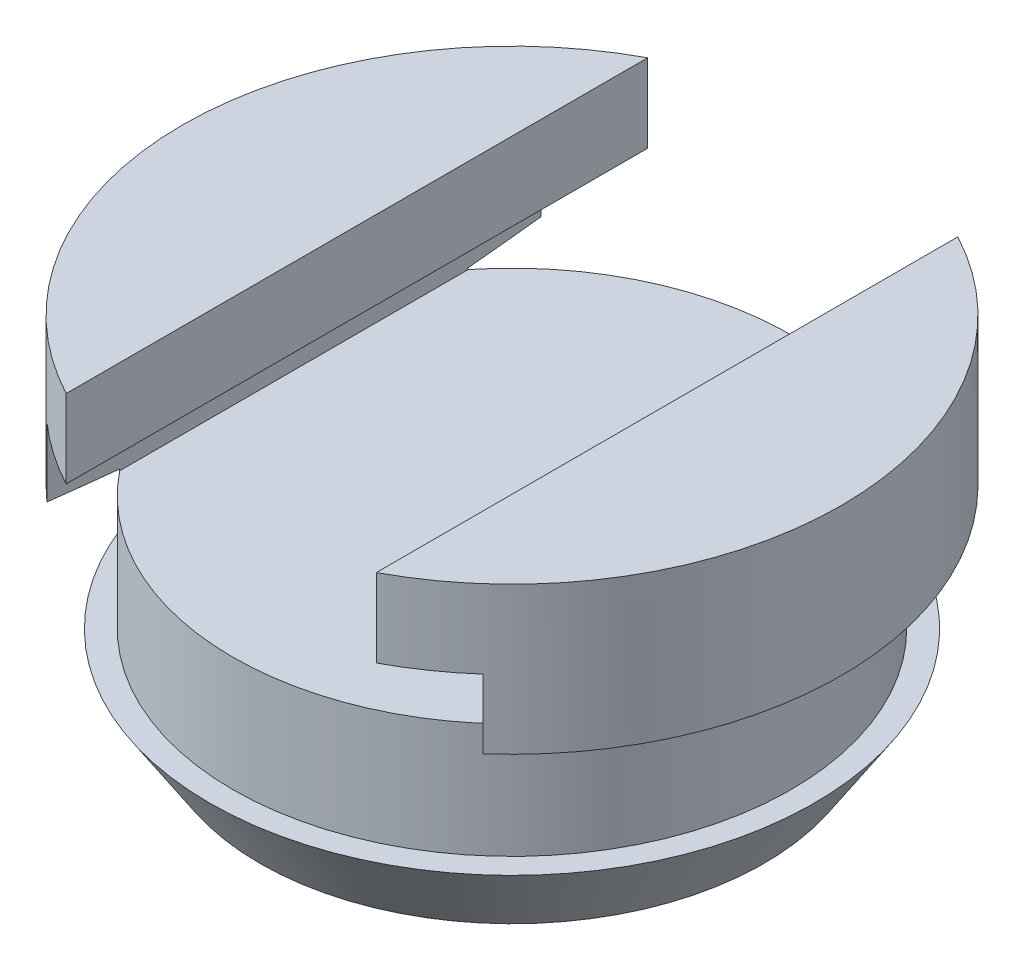
ISO-10303-21;
HEADER;
FILE_DESCRIPTION(('STEP AP214'),'2;1');
FILE_NAME('part.step','',(''),(''),'','','');
FILE_SCHEMA(('AUTOMOTIVE_DESIGN { 1 0 10303 214 1 1 1 1 }'));
ENDSEC;
DATA;
#1=APPLICATION_CONTEXT('core data for automotive mechanical design processes');
#2=APPLICATION_PROTOCOL_DEFINITION('international standard','automotive_design',2000,#1);
#3=PRODUCT_CONTEXT('',#1,'mechanical');
#4=PRODUCT('Part','Part','',(#3));
#5=PRODUCT_RELATED_PRODUCT_CATEGORY('part','',(#4));
#6=PRODUCT_DEFINITION_FORMATION('','',#4);
#7=PRODUCT_DEFINITION_CONTEXT('part definition',#1,'design');
#8=PRODUCT_DEFINITION('design','',#6,#7);
#9=PRODUCT_DEFINITION_SHAPE('','',#8);
#10=(LENGTH_UNIT() NAMED_UNIT(*) SI_UNIT(.MILLI.,.METRE.));
#11=(NAMED_UNIT(*) PLANE_ANGLE_UNIT() SI_UNIT($,.RADIAN.));
#12=(NAMED_UNIT(*) SI_UNIT($,.STERADIAN.) SOLID_ANGLE_UNIT());
#13=UNCERTAINTY_MEASURE_WITH_UNIT(LENGTH_MEASURE(1.E-05),#10,'distance_accuracy_value','');
#14=(GEOMETRIC_REPRESENTATION_CONTEXT(3) GLOBAL_UNCERTAINTY_ASSIGNED_CONTEXT((#13)) GLOBAL_UNIT_ASSIGNED_CONTEXT((#10,
#11,#12)) REPRESENTATION_CONTEXT('',''));
#15=CARTESIAN_POINT('',(0.,0.,0.));
#16=DIRECTION('',(0.,0.,1.));
#17=DIRECTION('',(1.,0.,0.));
#18=AXIS2_PLACEMENT_3D('',#15,#16,#17);
#19=CARTESIAN_POINT('',(0.,6.604,0.));
#20=DIRECTION('',(0.,1.,0.));
#21=DIRECTION('',(0.,0.,1.));
#22=AXIS2_PLACEMENT_3D('',#19,#20,#21);
#23=CONICAL_SURFACE('',#22,10.795,1.41814699839963);
#24=CARTESIAN_POINT('',(-7.14375,8.75880224403283,23.7500964395706));
#25=CARTESIAN_POINT('',(-7.14375,8.68545830838872,23.2522454636843));
#26=CARTESIAN_POINT('',(-7.14375,8.6122966619837,22.7543675871435));
#27=CARTESIAN_POINT('',(-7.14375,8.46642256016569,21.7585457203129));
#28=CARTESIAN_POINT('',(-7.14375,8.39371010504107,21.2606017299808));
#29=CARTESIAN_POINT('',(-7.14375,8.17636203087784,19.7665736462849));
#30=CARTESIAN_POINT('',(-7.14375,8.03252742900043,18.7703728475509));
#31=CARTESIAN_POINT('',(-7.14375,7.74699954261901,16.7702331852527));
#32=CARTESIAN_POINT('',(-7.14375,7.60532958718924,15.7662909735754));
#33=CARTESIAN_POINT('',(-7.14375,7.39672724895862,14.2598704855474));
#34=CARTESIAN_POINT('',(-7.14375,7.32784578219272,13.7576624116299));
#35=CARTESIAN_POINT('',(-7.14375,7.191783395673,12.7530162685798));
#36=CARTESIAN_POINT('',(-7.14375,7.12460247302872,12.2505781998396));
#37=CARTESIAN_POINT('',(-7.14375,6.99344303507243,11.2527972000541));
#38=CARTESIAN_POINT('',(-7.14375,6.92943195831776,10.7574585622264));
#39=CARTESIAN_POINT('',(-7.14375,6.80429722429823,9.76641486637786));
#40=CARTESIAN_POINT('',(-7.14375,6.74317356799173,9.27070980823546));
#41=CARTESIAN_POINT('',(-7.14375,6.62481704151099,8.27869135949145));
#42=CARTESIAN_POINT('',(-7.14375,6.56758526644491,7.78237783734458));
#43=CARTESIAN_POINT('',(-7.14375,6.45847693908099,6.78915246943178));
#44=CARTESIAN_POINT('',(-7.14375,6.40660042803776,6.29224061908644));
#45=CARTESIAN_POINT('',(-7.14375,6.31041302585768,5.29979831967755));
#46=CARTESIAN_POINT('',(-7.14375,6.26607102161061,4.80427093384614));
#47=CARTESIAN_POINT('',(-7.14375,6.18727074583277,3.81241490809113));
#48=CARTESIAN_POINT('',(-7.14375,6.15281241667466,3.31608627285624));
#49=CARTESIAN_POINT('',(-7.14375,6.09673849180338,2.32301207625759));
#50=CARTESIAN_POINT('',(-7.14375,6.07511432607424,1.82626701541841));
#51=CARTESIAN_POINT('',(-7.14375,6.04715537058307,0.832351873435141));
#52=CARTESIAN_POINT('',(-7.14375,6.04081984169489,0.335181814000032));
#53=CARTESIAN_POINT('',(-7.14375,6.04426028953633,-0.652452401059567));
#54=CARTESIAN_POINT('',(-7.14375,6.05382200405463,-1.14291734869228));
#55=CARTESIAN_POINT('',(-7.14375,6.08742376997524,-2.12335555168535));
#56=CARTESIAN_POINT('',(-7.14375,6.11146454816321,-2.61332878112687));
#57=CARTESIAN_POINT('',(-7.14375,6.17149001611071,-3.59284958134047));
#58=CARTESIAN_POINT('',(-7.14375,6.20748269895532,-4.08239664683994));
#59=CARTESIAN_POINT('',(-7.14375,6.28860674587545,-5.06071612781277));
#60=CARTESIAN_POINT('',(-7.14375,6.33373810402482,-5.54948854378826));
#61=CARTESIAN_POINT('',(-7.14375,6.43095665664812,-6.52842166613945));
#62=CARTESIAN_POINT('',(-7.14375,6.48307249712573,-7.01857948673738));
#63=CARTESIAN_POINT('',(-7.14375,6.59227623557887,-7.99833293609698));
#64=CARTESIAN_POINT('',(-7.14375,6.64936410649861,-8.48792856790317));
#65=CARTESIAN_POINT('',(-7.14375,6.76717259303672,-9.46653573875994));
#66=CARTESIAN_POINT('',(-7.14375,6.8278921500628,-9.95554740604659));
#67=CARTESIAN_POINT('',(-7.14375,6.95204277529969,-10.9332246524786));
#68=CARTESIAN_POINT('',(-7.14375,7.01547384186773,-11.4218902318335));
#69=CARTESIAN_POINT('',(-7.14375,7.14532864311168,-12.4061280816276));
#70=CARTESIAN_POINT('',(-7.14375,7.21178265386601,-12.9016963462918));
#71=CARTESIAN_POINT('',(-7.14375,7.34630474450734,-13.8926140412298));
#72=CARTESIAN_POINT('',(-7.14375,7.4143728268953,-14.3879634711632));
#73=CARTESIAN_POINT('',(-7.14375,7.62044673473379,-15.8738271597175));
#74=CARTESIAN_POINT('',(-7.14375,7.76031238824422,-16.8640832145148));
#75=CARTESIAN_POINT('',(-7.14375,8.04215373343174,-18.8371741555606));
#76=CARTESIAN_POINT('',(-7.14375,8.18410761643245,-19.8200121729003));
#77=CARTESIAN_POINT('',(-7.14375,8.39858388265517,-21.2940001366979));
#78=CARTESIAN_POINT('',(-7.14375,8.47033037563487,-21.7852631499297));
#79=CARTESIAN_POINT('',(-7.14375,8.61425946722529,-22.7677249895695));
#80=CARTESIAN_POINT('',(-7.14375,8.6864420655663,-23.2589238160171));
#81=CARTESIAN_POINT('',(-7.14375,8.75880224403284,-23.7500964395706));
#82=B_SPLINE_CURVE_WITH_KNOTS('',3,(#24,#25,#26,#27,#28,#29,#30,#31,#32,#33,#34,#35,#36,#37,#38,
#39,#40,#41,#42,#43,#44,#45,#46,#47,#48,#49,#50,#51,#52,#53,#54,#55,#56,#57,#58,#59,#60,#61,#62,
#63,#64,#65,#66,#67,#68,#69,#70,#71,#72,#73,#74,#75,#76,#77,#78,#79,#80,#81),.UNSPECIFIED.,.F.,
.F.,(4,2,2,2,2,2,2,2,2,2,2,2,2,2,2,2,2,2,2,2,2,2,2,2,2,2,2,2,4),(0.,1.50967360423503,
3.01934817759427,6.03893812915711,9.08059422786816,10.6013216949664,12.122046577081,
13.6204128620093,15.1187796442554,16.6175663112219,18.116364523325,19.6088146673642,
21.1012561094112,22.5926998487758,24.0840714831403,25.5555049848284,27.0270123521971,
28.4995058093978,29.9719983117353,31.4507262548678,32.9294461518615,34.407737101,
35.8860271545349,37.38603585638,38.886046882608,41.8862917013799,44.865398588286,
46.3548218496045,47.8442441899191),.UNSPECIFIED.);
#83=CARTESIAN_POINT('',(-7.14375,6.604,8.09313665629711));
#84=VERTEX_POINT('',#83);
#85=CARTESIAN_POINT('',(-7.14375,6.34999999999993,5.70785177956648));
#86=VERTEX_POINT('',#85);
#87=EDGE_CURVE('E54',#84,#86,#82,.T.);
#88=ORIENTED_EDGE('',*,*,#87,.F.);
#89=CARTESIAN_POINT('',(0.,6.604,0.));
#90=DIRECTION('',(0.,1.,0.));
#91=DIRECTION('',(0.,0.,1.));
#92=AXIS2_PLACEMENT_3D('',#89,#90,#91);
#93=CIRCLE('',#92,10.795);
#94=CARTESIAN_POINT('',(-7.14375,6.604,-8.09313665629711));
#95=VERTEX_POINT('',#94);
#96=EDGE_CURVE('E172',#95,#84,#93,.T.);
#97=ORIENTED_EDGE('',*,*,#96,.F.);
#98=CARTESIAN_POINT('',(-7.14375,6.34999999999996,-5.70785177956647));
#99=VERTEX_POINT('',#98);
#100=EDGE_CURVE('E180',#99,#95,#82,.T.);
#101=ORIENTED_EDGE('',*,*,#100,.F.);
#102=CARTESIAN_POINT('',(0.,6.35,0.));
#103=DIRECTION('',(0.,1.,0.));
#104=DIRECTION('',(0.,0.,1.));
#105=AXIS2_PLACEMENT_3D('',#102,#103,#104);
#106=CIRCLE('',#105,9.144);
#107=EDGE_CURVE('E169',#99,#86,#106,.T.);
#108=ORIENTED_EDGE('',*,*,#107,.T.);
#109=EDGE_LOOP('',(#88,#97,#101,#108));
#110=FACE_BOUND('',#109,.T.);
#111=ADVANCED_FACE('F31',(#110),#23,.T.);
#112=CARTESIAN_POINT('',(0.,11.43,0.));
#113=DIRECTION('',(0.,1.,0.));
#114=DIRECTION('',(0.,0.,1.));
#115=AXIS2_PLACEMENT_3D('',#112,#113,#114);
#116=CYLINDRICAL_SURFACE('',#115,10.795);
#117=DIRECTION('',(0.,1.,0.));
#118=VECTOR('',#117,1.);
#119=CARTESIAN_POINT('',(-7.14375,11.43,8.09313665629711));
#120=LINE('',#119,#118);
#121=CARTESIAN_POINT('',(-7.14375,8.86398020583783,8.09313665629711));
#122=VERTEX_POINT('',#121);
#123=EDGE_CURVE('E226',#122,#84,#120,.F.);
#124=ORIENTED_EDGE('',*,*,#123,.F.);
#125=CARTESIAN_POINT('',(0.,8.86398020583783,0.));
#126=DIRECTION('',(0.,1.,0.));
#127=DIRECTION('',(0.,0.,1.));
#128=AXIS2_PLACEMENT_3D('',#125,#126,#127);
#129=CIRCLE('',#128,10.795);
#130=CARTESIAN_POINT('',(-5.08,8.86398020583783,9.525));
#131=VERTEX_POINT('',#130);
#132=EDGE_CURVE('E147',#131,#122,#129,.F.);
#133=ORIENTED_EDGE('',*,*,#132,.F.);
#134=DIRECTION('',(0.,1.,0.));
#135=VECTOR('',#134,1.);
#136=CARTESIAN_POINT('',(-5.08,11.43,9.525));
#137=LINE('',#136,#135);
#138=CARTESIAN_POINT('',(-5.08,11.43,9.525));
#139=VERTEX_POINT('',#138);
#140=EDGE_CURVE('E257',#139,#131,#137,.F.);
#141=ORIENTED_EDGE('',*,*,#140,.F.);
#142=CARTESIAN_POINT('',(0.,11.43,0.));
#143=DIRECTION('',(0.,1.,0.));
#144=DIRECTION('',(0.,0.,1.));
#145=AXIS2_PLACEMENT_3D('',#142,#143,#144);
#146=CIRCLE('',#145,10.795);
#147=CARTESIAN_POINT('',(-5.08,11.43,-9.525));
#148=VERTEX_POINT('',#147);
#149=EDGE_CURVE('E175',#148,#139,#146,.T.);
#150=ORIENTED_EDGE('',*,*,#149,.F.);
#151=DIRECTION('',(0.,1.,0.));
#152=VECTOR('',#151,1.);
#153=CARTESIAN_POINT('',(-5.08,11.43,-9.525));
#154=LINE('',#153,#152);
#155=CARTESIAN_POINT('',(-5.08,8.86398020583783,-9.525));
#156=VERTEX_POINT('',#155);
#157=EDGE_CURVE('E127',#156,#148,#154,.T.);
#158=ORIENTED_EDGE('',*,*,#157,.F.);
#159=CARTESIAN_POINT('',(-7.14375,8.86398020583783,-8.09313665629711));
#160=VERTEX_POINT('',#159);
#161=EDGE_CURVE('E143',#160,#156,#129,.F.);
#162=ORIENTED_EDGE('',*,*,#161,.F.);
#163=DIRECTION('',(0.,1.,0.));
#164=VECTOR('',#163,1.);
#165=CARTESIAN_POINT('',(-7.14375,11.43,-8.09313665629711));
#166=LINE('',#165,#164);
#167=EDGE_CURVE('E145',#95,#160,#166,.T.);
#168=ORIENTED_EDGE('',*,*,#167,.F.);
#169=ORIENTED_EDGE('',*,*,#96,.T.);
#170=EDGE_LOOP('',(#124,#133,#141,#150,#158,#162,#168,#169));
#171=FACE_BOUND('',#170,.T.);
#172=ADVANCED_FACE('F206',(#171),#116,.T.);
#173=CARTESIAN_POINT('',(-10.795,11.43,0.));
#174=DIRECTION('',(0.,1.,0.));
#175=DIRECTION('',(0.,0.,1.));
#176=AXIS2_PLACEMENT_3D('',#173,#174,#175);
#177=PLANE('',#176);
#178=DIRECTION('',(0.,0.,1.));
#179=VECTOR('',#178,1.);
#180=CARTESIAN_POINT('',(-5.08,11.43,0.));
#181=LINE('',#180,#179);
#182=EDGE_CURVE('E151',#148,#139,#181,.T.);
#183=ORIENTED_EDGE('',*,*,#182,.F.);
#184=ORIENTED_EDGE('',*,*,#149,.T.);
#185=EDGE_LOOP('',(#183,#184));
#186=FACE_BOUND('',#185,.T.);
#187=ADVANCED_FACE('F204',(#186),#177,.T.);
#188=CARTESIAN_POINT('',(0.,0.,0.));
#189=DIRECTION('',(0.,-1.,0.));
#190=DIRECTION('',(0.,0.,-1.));
#191=AXIS2_PLACEMENT_3D('',#188,#189,#190);
#192=PLANE('',#191);
#193=CARTESIAN_POINT('',(0.,0.,0.));
#194=DIRECTION('',(0.,1.,0.));
#195=DIRECTION('',(0.,0.,1.));
#196=AXIS2_PLACEMENT_3D('',#193,#194,#195);
#197=CIRCLE('',#196,8.255);
#198=CARTESIAN_POINT('',(0.,0.,8.255));
#199=VERTEX_POINT('',#198);
#200=EDGE_CURVE('E157',#199,#199,#197,.T.);
#201=ORIENTED_EDGE('',*,*,#200,.F.);
#202=EDGE_LOOP('',(#201));
#203=FACE_BOUND('',#202,.T.);
#204=ADVANCED_FACE('F33',(#203),#192,.T.);
#205=CARTESIAN_POINT('',(0.,2.54,0.));
#206=DIRECTION('',(0.,1.,0.));
#207=DIRECTION('',(0.,0.,1.));
#208=AXIS2_PLACEMENT_3D('',#205,#206,#207);
#209=CONICAL_SURFACE('',#208,9.906,0.576375220591184);
#210=ORIENTED_EDGE('',*,*,#200,.T.);
#211=EDGE_LOOP('',(#210));
#212=FACE_BOUND('',#211,.T.);
#213=CARTESIAN_POINT('',(0.,2.54,0.));
#214=DIRECTION('',(0.,1.,0.));
#215=DIRECTION('',(0.,0.,1.));
#216=AXIS2_PLACEMENT_3D('',#213,#214,#215);
#217=CIRCLE('',#216,9.906);
#218=CARTESIAN_POINT('',(0.,2.54,9.906));
#219=VERTEX_POINT('',#218);
#220=EDGE_CURVE('E160',#219,#219,#217,.T.);
#221=ORIENTED_EDGE('',*,*,#220,.F.);
#222=EDGE_LOOP('',(#221));
#223=FACE_BOUND('',#222,.T.);
#224=ADVANCED_FACE('F292',(#212,#223),#209,.T.);
#225=CARTESIAN_POINT('',(-9.144,2.54,0.));
#226=DIRECTION('',(0.,1.,0.));
#227=DIRECTION('',(0.,0.,1.));
#228=AXIS2_PLACEMENT_3D('',#225,#226,#227);
#229=PLANE('',#228);
#230=ORIENTED_EDGE('',*,*,#220,.T.);
#231=EDGE_LOOP('',(#230));
#232=FACE_BOUND('',#231,.T.);
#233=CARTESIAN_POINT('',(0.,2.54,0.));
#234=DIRECTION('',(0.,1.,0.));
#235=DIRECTION('',(0.,0.,1.));
#236=AXIS2_PLACEMENT_3D('',#233,#234,#235);
#237=CIRCLE('',#236,9.144);
#238=CARTESIAN_POINT('',(0.,2.54,9.144));
#239=VERTEX_POINT('',#238);
#240=EDGE_CURVE('E163',#239,#239,#237,.T.);
#241=ORIENTED_EDGE('',*,*,#240,.F.);
#242=EDGE_LOOP('',(#241));
#243=FACE_BOUND('',#242,.T.);
#244=ADVANCED_FACE('F297',(#232,#243),#229,.T.);
#245=CARTESIAN_POINT('',(0.,11.43,0.));
#246=DIRECTION('',(0.,1.,0.));
#247=DIRECTION('',(0.,0.,1.));
#248=AXIS2_PLACEMENT_3D('',#245,#246,#247);
#249=CYLINDRICAL_SURFACE('',#248,9.144);
#250=DIRECTION('',(0.,1.,0.));
#251=VECTOR('',#250,1.);
#252=CARTESIAN_POINT('',(-7.14375,11.43,5.70785177956646));
#253=LINE('',#252,#251);
#254=CARTESIAN_POINT('',(-7.14375,6.29858020583783,5.70785177956646));
#255=VERTEX_POINT('',#254);
#256=EDGE_CURVE('E176',#86,#255,#253,.F.);
#257=ORIENTED_EDGE('',*,*,#256,.F.);
#258=ORIENTED_EDGE('',*,*,#107,.F.);
#259=DIRECTION('',(0.,1.,0.));
#260=VECTOR('',#259,1.);
#261=CARTESIAN_POINT('',(-7.14375,11.43,-5.70785177956646));
#262=LINE('',#261,#260);
#263=CARTESIAN_POINT('',(-7.14375,6.29858020583783,-5.70785177956646));
#264=VERTEX_POINT('',#263);
#265=EDGE_CURVE('E178',#264,#99,#262,.T.);
#266=ORIENTED_EDGE('',*,*,#265,.F.);
#267=CARTESIAN_POINT('',(0.,6.29858020583783,0.));
#268=DIRECTION('',(0.,-1.,0.));
#269=DIRECTION('',(0.,0.,-1.));
#270=AXIS2_PLACEMENT_3D('',#267,#268,#269);
#271=CIRCLE('',#270,9.144);
#272=CARTESIAN_POINT('',(7.14375,6.29858020583783,-5.70785177956646));
#273=VERTEX_POINT('',#272);
#274=EDGE_CURVE('E35',#273,#264,#271,.F.);
#275=ORIENTED_EDGE('',*,*,#274,.F.);
#276=DIRECTION('',(0.,1.,0.));
#277=VECTOR('',#276,1.);
#278=CARTESIAN_POINT('',(7.14375,11.43,-5.70785177956646));
#279=LINE('',#278,#277);
#280=CARTESIAN_POINT('',(7.14375,6.34999999999993,-5.70785177956648));
#281=VERTEX_POINT('',#280);
#282=EDGE_CURVE('E187',#281,#273,#279,.F.);
#283=ORIENTED_EDGE('',*,*,#282,.F.);
#284=CARTESIAN_POINT('',(7.14375,6.34999999999996,5.70785177956647));
#285=VERTEX_POINT('',#284);
#286=EDGE_CURVE('E166',#285,#281,#106,.T.);
#287=ORIENTED_EDGE('',*,*,#286,.F.);
#288=DIRECTION('',(0.,1.,0.));
#289=VECTOR('',#288,1.);
#290=CARTESIAN_POINT('',(7.14375,11.43,5.70785177956646));
#291=LINE('',#290,#289);
#292=CARTESIAN_POINT('',(7.14375,6.29858020583783,5.70785177956646));
#293=VERTEX_POINT('',#292);
#294=EDGE_CURVE('E248',#293,#285,#291,.T.);
#295=ORIENTED_EDGE('',*,*,#294,.F.);
#296=EDGE_CURVE('E11',#255,#293,#271,.F.);
#297=ORIENTED_EDGE('',*,*,#296,.F.);
#298=EDGE_LOOP('',(#257,#258,#266,#275,#283,#287,#295,#297));
#299=FACE_BOUND('',#298,.T.);
#300=ORIENTED_EDGE('',*,*,#240,.T.);
#301=EDGE_LOOP('',(#300));
#302=FACE_BOUND('',#301,.T.);
#303=ADVANCED_FACE('F210',(#299,#302),#249,.T.);
#304=CARTESIAN_POINT('',(7.14375,8.75880224403283,-23.7500964395706));
#305=CARTESIAN_POINT('',(7.14375,8.68545830838872,-23.2522454636843));
#306=CARTESIAN_POINT('',(7.14375,8.6122966619837,-22.7543675871435));
#307=CARTESIAN_POINT('',(7.14375,8.46642256016569,-21.7585457203129));
#308=CARTESIAN_POINT('',(7.14375,8.39371010504107,-21.2606017299808));
#309=CARTESIAN_POINT('',(7.14375,8.17636203087784,-19.7665736462849));
#310=CARTESIAN_POINT('',(7.14375,8.03252742900043,-18.7703728475509));
#311=CARTESIAN_POINT('',(7.14375,7.74699954261901,-16.7702331852527));
#312=CARTESIAN_POINT('',(7.14375,7.60532958718924,-15.7662909735754));
#313=CARTESIAN_POINT('',(7.14375,7.39672724895862,-14.2598704855474));
#314=CARTESIAN_POINT('',(7.14375,7.32784578219272,-13.7576624116299));
#315=CARTESIAN_POINT('',(7.14375,7.191783395673,-12.7530162685798));
#316=CARTESIAN_POINT('',(7.14375,7.12460247302872,-12.2505781998396));
#317=CARTESIAN_POINT('',(7.14375,6.99344303507243,-11.2527972000541));
#318=CARTESIAN_POINT('',(7.14375,6.92943195831776,-10.7574585622264));
#319=CARTESIAN_POINT('',(7.14375,6.80429722429823,-9.76641486637786));
#320=CARTESIAN_POINT('',(7.14375,6.74317356799173,-9.27070980823546));
#321=CARTESIAN_POINT('',(7.14375,6.62481704151099,-8.27869135949145));
#322=CARTESIAN_POINT('',(7.14375,6.56758526644491,-7.78237783734458));
#323=CARTESIAN_POINT('',(7.14375,6.45847693908099,-6.78915246943178));
#324=CARTESIAN_POINT('',(7.14375,6.40660042803776,-6.29224061908644));
#325=CARTESIAN_POINT('',(7.14375,6.31041302585768,-5.29979831967755));
#326=CARTESIAN_POINT('',(7.14375,6.26607102161061,-4.80427093384614));
#327=CARTESIAN_POINT('',(7.14375,6.18727074583277,-3.81241490809113));
#328=CARTESIAN_POINT('',(7.14375,6.15281241667466,-3.31608627285624));
#329=CARTESIAN_POINT('',(7.14375,6.09673849180338,-2.32301207625759));
#330=CARTESIAN_POINT('',(7.14375,6.07511432607424,-1.82626701541841));
#331=CARTESIAN_POINT('',(7.14375,6.04715537058307,-0.832351873435141));
#332=CARTESIAN_POINT('',(7.14375,6.04081984169489,-0.335181814000032));
#333=CARTESIAN_POINT('',(7.14375,6.04426028953633,0.652452401059567));
#334=CARTESIAN_POINT('',(7.14375,6.05382200405463,1.14291734869228));
#335=CARTESIAN_POINT('',(7.14375,6.08742376997524,2.12335555168535));
#336=CARTESIAN_POINT('',(7.14375,6.11146454816321,2.61332878112687));
#337=CARTESIAN_POINT('',(7.14375,6.17149001611071,3.59284958134047));
#338=CARTESIAN_POINT('',(7.14375,6.20748269895532,4.08239664683994));
#339=CARTESIAN_POINT('',(7.14375,6.28860674587545,5.06071612781277));
#340=CARTESIAN_POINT('',(7.14375,6.33373810402482,5.54948854378826));
#341=CARTESIAN_POINT('',(7.14375,6.43095665664812,6.52842166613945));
#342=CARTESIAN_POINT('',(7.14375,6.48307249712573,7.01857948673738));
#343=CARTESIAN_POINT('',(7.14375,6.59227623557887,7.99833293609698));
#344=CARTESIAN_POINT('',(7.14375,6.64936410649861,8.48792856790317));
#345=CARTESIAN_POINT('',(7.14375,6.76717259303672,9.46653573875994));
#346=CARTESIAN_POINT('',(7.14375,6.8278921500628,9.95554740604659));
#347=CARTESIAN_POINT('',(7.14375,6.95204277529969,10.9332246524786));
#348=CARTESIAN_POINT('',(7.14375,7.01547384186773,11.4218902318335));
#349=CARTESIAN_POINT('',(7.14375,7.14532864311168,12.4061280816276));
#350=CARTESIAN_POINT('',(7.14375,7.21178265386601,12.9016963462918));
#351=CARTESIAN_POINT('',(7.14375,7.34630474450734,13.8926140412298));
#352=CARTESIAN_POINT('',(7.14375,7.4143728268953,14.3879634711632));
#353=CARTESIAN_POINT('',(7.14375,7.62044673473379,15.8738271597175));
#354=CARTESIAN_POINT('',(7.14375,7.76031238824422,16.8640832145148));
#355=CARTESIAN_POINT('',(7.14375,8.04215373343174,18.8371741555606));
#356=CARTESIAN_POINT('',(7.14375,8.18410761643245,19.8200121729003));
#357=CARTESIAN_POINT('',(7.14375,8.39858388265517,21.2940001366979));
#358=CARTESIAN_POINT('',(7.14375,8.47033037563487,21.7852631499297));
#359=CARTESIAN_POINT('',(7.14375,8.61425946722529,22.7677249895695));
#360=CARTESIAN_POINT('',(7.14375,8.6864420655663,23.2589238160171));
#361=CARTESIAN_POINT('',(7.14375,8.75880224403284,23.7500964395706));
#362=B_SPLINE_CURVE_WITH_KNOTS('',3,(#304,#305,#306,#307,#308,#309,#310,#311,#312,#313,#314,
#315,#316,#317,#318,#319,#320,#321,#322,#323,#324,#325,#326,#327,#328,#329,#330,#331,#332,#333,
#334,#335,#336,#337,#338,#339,#340,#341,#342,#343,#344,#345,#346,#347,#348,#349,#350,#351,#352,
#353,#354,#355,#356,#357,#358,#359,#360,#361),.UNSPECIFIED.,.F.,.F.,(4,2,2,2,2,2,2,2,2,2,2,2,2,
2,2,2,2,2,2,2,2,2,2,2,2,2,2,2,4),(0.,1.50967360423503,3.01934817759427,6.03893812915711,
9.08059422786816,10.6013216949664,12.122046577081,13.6204128620093,15.1187796442554,
16.6175663112219,18.116364523325,19.6088146673642,21.1012561094112,22.5926998487758,
24.0840714831403,25.5555049848284,27.0270123521971,28.4995058093978,29.9719983117353,
31.4507262548678,32.9294461518615,34.407737101,35.8860271545349,37.38603585638,38.886046882608,
41.8862917013799,44.865398588286,46.3548218496045,47.8442441899191),.UNSPECIFIED.);
#363=CARTESIAN_POINT('',(7.14375,6.604,-8.09313665629711));
#364=VERTEX_POINT('',#363);
#365=EDGE_CURVE('E263',#364,#281,#362,.T.);
#366=ORIENTED_EDGE('',*,*,#365,.F.);
#367=CARTESIAN_POINT('',(7.14375,6.604,8.09313665629711));
#368=VERTEX_POINT('',#367);
#369=EDGE_CURVE('E170',#368,#364,#93,.T.);
#370=ORIENTED_EDGE('',*,*,#369,.F.);
#371=EDGE_CURVE('E259',#285,#368,#362,.T.);
#372=ORIENTED_EDGE('',*,*,#371,.F.);
#373=ORIENTED_EDGE('',*,*,#286,.T.);
#374=EDGE_LOOP('',(#366,#370,#372,#373));
#375=FACE_BOUND('',#374,.T.);
#376=ADVANCED_FACE('F189',(#375),#23,.T.);
#377=DIRECTION('',(0.,1.,0.));
#378=VECTOR('',#377,1.);
#379=CARTESIAN_POINT('',(5.08,11.43,-9.525));
#380=LINE('',#379,#378);
#381=CARTESIAN_POINT('',(5.08,11.43,-9.525));
#382=VERTEX_POINT('',#381);
#383=CARTESIAN_POINT('',(5.08,8.86398020583783,-9.525));
#384=VERTEX_POINT('',#383);
#385=EDGE_CURVE('E118',#382,#384,#380,.F.);
#386=ORIENTED_EDGE('',*,*,#385,.F.);
#387=CARTESIAN_POINT('',(5.08,11.43,9.525));
#388=VERTEX_POINT('',#387);
#389=EDGE_CURVE('E173',#388,#382,#146,.T.);
#390=ORIENTED_EDGE('',*,*,#389,.F.);
#391=DIRECTION('',(0.,1.,0.));
#392=VECTOR('',#391,1.);
#393=CARTESIAN_POINT('',(5.08,11.43,9.525));
#394=LINE('',#393,#392);
#395=CARTESIAN_POINT('',(5.08,8.86398020583783,9.525));
#396=VERTEX_POINT('',#395);
#397=EDGE_CURVE('E46',#396,#388,#394,.T.);
#398=ORIENTED_EDGE('',*,*,#397,.F.);
#399=CARTESIAN_POINT('',(0.,8.86398020583783,0.));
#400=DIRECTION('',(0.,1.,0.));
#401=DIRECTION('',(0.,0.,1.));
#402=AXIS2_PLACEMENT_3D('',#399,#400,#401);
#403=CIRCLE('',#402,10.795);
#404=CARTESIAN_POINT('',(7.14375,8.86398020583783,8.09313665629711));
#405=VERTEX_POINT('',#404);
#406=EDGE_CURVE('E135',#405,#396,#403,.F.);
#407=ORIENTED_EDGE('',*,*,#406,.F.);
#408=DIRECTION('',(0.,1.,0.));
#409=VECTOR('',#408,1.);
#410=CARTESIAN_POINT('',(7.14375,11.43,8.09313665629711));
#411=LINE('',#410,#409);
#412=EDGE_CURVE('E150',#368,#405,#411,.T.);
#413=ORIENTED_EDGE('',*,*,#412,.F.);
#414=ORIENTED_EDGE('',*,*,#369,.T.);
#415=DIRECTION('',(0.,1.,0.));
#416=VECTOR('',#415,1.);
#417=CARTESIAN_POINT('',(7.14375,11.43,-8.09313665629711));
#418=LINE('',#417,#416);
#419=CARTESIAN_POINT('',(7.14375,8.86398020583783,-8.09313665629711));
#420=VERTEX_POINT('',#419);
#421=EDGE_CURVE('E142',#420,#364,#418,.F.);
#422=ORIENTED_EDGE('',*,*,#421,.F.);
#423=EDGE_CURVE('E132',#384,#420,#403,.F.);
#424=ORIENTED_EDGE('',*,*,#423,.F.);
#425=EDGE_LOOP('',(#386,#390,#398,#407,#413,#414,#422,#424));
#426=FACE_BOUND('',#425,.T.);
#427=ADVANCED_FACE('F140',(#426),#116,.T.);
#428=DIRECTION('',(0.,0.,-1.));
#429=VECTOR('',#428,1.);
#430=CARTESIAN_POINT('',(5.08,11.43,0.));
#431=LINE('',#430,#429);
#432=EDGE_CURVE('E122',#388,#382,#431,.T.);
#433=ORIENTED_EDGE('',*,*,#432,.F.);
#434=ORIENTED_EDGE('',*,*,#389,.T.);
#435=EDGE_LOOP('',(#433,#434));
#436=FACE_BOUND('',#435,.T.);
#437=ADVANCED_FACE('F199',(#436),#177,.T.);
#438=CARTESIAN_POINT('',(-7.14375,6.29858020583783,-19.05));
#439=DIRECTION('',(-1.,0.,0.));
#440=DIRECTION('',(0.,0.,1.));
#441=AXIS2_PLACEMENT_3D('',#438,#439,#440);
#442=PLANE('',#441);
#443=ORIENTED_EDGE('',*,*,#256,.T.);
#444=DIRECTION('',(0.,0.,1.));
#445=VECTOR('',#444,1.);
#446=CARTESIAN_POINT('',(-7.14375,6.29858020583783,-19.05));
#447=LINE('',#446,#445);
#448=EDGE_CURVE('E237',#264,#255,#447,.T.);
#449=ORIENTED_EDGE('',*,*,#448,.F.);
#450=ORIENTED_EDGE('',*,*,#265,.T.);
#451=ORIENTED_EDGE('',*,*,#100,.T.);
#452=ORIENTED_EDGE('',*,*,#167,.T.);
#453=DIRECTION('',(0.,0.,1.));
#454=VECTOR('',#453,1.);
#455=CARTESIAN_POINT('',(-7.14375,8.86398020583783,-19.05));
#456=LINE('',#455,#454);
#457=EDGE_CURVE('E254',#160,#122,#456,.T.);
#458=ORIENTED_EDGE('',*,*,#457,.T.);
#459=ORIENTED_EDGE('',*,*,#123,.T.);
#460=ORIENTED_EDGE('',*,*,#87,.T.);
#461=EDGE_LOOP('',(#443,#449,#450,#451,#452,#458,#459,#460));
#462=FACE_BOUND('',#461,.T.);
#463=ADVANCED_FACE('F193',(#462),#442,.F.);
#464=CARTESIAN_POINT('',(-7.14375,8.86398020583783,-19.05));
#465=DIRECTION('',(0.,1.,0.));
#466=DIRECTION('',(0.,0.,1.));
#467=AXIS2_PLACEMENT_3D('',#464,#465,#466);
#468=PLANE('',#467);
#469=ORIENTED_EDGE('',*,*,#132,.T.);
#470=ORIENTED_EDGE('',*,*,#457,.F.);
#471=ORIENTED_EDGE('',*,*,#161,.T.);
#472=DIRECTION('',(0.,0.,1.));
#473=VECTOR('',#472,1.);
#474=CARTESIAN_POINT('',(-5.08,8.86398020583783,-19.05));
#475=LINE('',#474,#473);
#476=EDGE_CURVE('E136',#156,#131,#475,.T.);
#477=ORIENTED_EDGE('',*,*,#476,.T.);
#478=EDGE_LOOP('',(#469,#470,#471,#477));
#479=FACE_BOUND('',#478,.T.);
#480=ADVANCED_FACE('F198',(#479),#468,.F.);
#481=CARTESIAN_POINT('',(-5.08,8.86398020583783,-19.05));
#482=DIRECTION('',(-1.,0.,0.));
#483=DIRECTION('',(0.,0.,1.));
#484=AXIS2_PLACEMENT_3D('',#481,#482,#483);
#485=PLANE('',#484);
#486=ORIENTED_EDGE('',*,*,#140,.T.);
#487=ORIENTED_EDGE('',*,*,#476,.F.);
#488=ORIENTED_EDGE('',*,*,#157,.T.);
#489=ORIENTED_EDGE('',*,*,#182,.T.);
#490=EDGE_LOOP('',(#486,#487,#488,#489));
#491=FACE_BOUND('',#490,.T.);
#492=ADVANCED_FACE('F271',(#491),#485,.F.);
#493=CARTESIAN_POINT('',(5.08,8.86398020583783,-19.05));
#494=DIRECTION('',(1.,0.,0.));
#495=DIRECTION('',(0.,0.,-1.));
#496=AXIS2_PLACEMENT_3D('',#493,#494,#495);
#497=PLANE('',#496);
#498=ORIENTED_EDGE('',*,*,#385,.T.);
#499=DIRECTION('',(0.,0.,1.));
#500=VECTOR('',#499,1.);
#501=CARTESIAN_POINT('',(5.08,8.86398020583783,-19.05));
#502=LINE('',#501,#500);
#503=EDGE_CURVE('E121',#384,#396,#502,.T.);
#504=ORIENTED_EDGE('',*,*,#503,.T.);
#505=ORIENTED_EDGE('',*,*,#397,.T.);
#506=ORIENTED_EDGE('',*,*,#432,.T.);
#507=EDGE_LOOP('',(#498,#504,#505,#506));
#508=FACE_BOUND('',#507,.T.);
#509=ADVANCED_FACE('F120',(#508),#497,.F.);
#510=CARTESIAN_POINT('',(7.14375,8.86398020583783,-19.05));
#511=DIRECTION('',(0.,1.,0.));
#512=DIRECTION('',(0.,0.,1.));
#513=AXIS2_PLACEMENT_3D('',#510,#511,#512);
#514=PLANE('',#513);
#515=ORIENTED_EDGE('',*,*,#423,.T.);
#516=DIRECTION('',(0.,0.,1.));
#517=VECTOR('',#516,1.);
#518=CARTESIAN_POINT('',(7.14375,8.86398020583783,-19.05));
#519=LINE('',#518,#517);
#520=EDGE_CURVE('E137',#420,#405,#519,.T.);
#521=ORIENTED_EDGE('',*,*,#520,.T.);
#522=ORIENTED_EDGE('',*,*,#406,.T.);
#523=ORIENTED_EDGE('',*,*,#503,.F.);
#524=EDGE_LOOP('',(#515,#521,#522,#523));
#525=FACE_BOUND('',#524,.T.);
#526=ADVANCED_FACE('F130',(#525),#514,.F.);
#527=CARTESIAN_POINT('',(7.14375,6.29858020583783,-19.05));
#528=DIRECTION('',(1.,0.,0.));
#529=DIRECTION('',(0.,0.,-1.));
#530=AXIS2_PLACEMENT_3D('',#527,#528,#529);
#531=PLANE('',#530);
#532=ORIENTED_EDGE('',*,*,#282,.T.);
#533=DIRECTION('',(0.,0.,1.));
#534=VECTOR('',#533,1.);
#535=CARTESIAN_POINT('',(7.14375,6.29858020583783,-19.05));
#536=LINE('',#535,#534);
#537=EDGE_CURVE('E240',#273,#293,#536,.T.);
#538=ORIENTED_EDGE('',*,*,#537,.T.);
#539=ORIENTED_EDGE('',*,*,#294,.T.);
#540=ORIENTED_EDGE('',*,*,#371,.T.);
#541=ORIENTED_EDGE('',*,*,#412,.T.);
#542=ORIENTED_EDGE('',*,*,#520,.F.);
#543=ORIENTED_EDGE('',*,*,#421,.T.);
#544=ORIENTED_EDGE('',*,*,#365,.T.);
#545=EDGE_LOOP('',(#532,#538,#539,#540,#541,#542,#543,#544));
#546=FACE_BOUND('',#545,.T.);
#547=ADVANCED_FACE('F249',(#546),#531,.F.);
#548=CARTESIAN_POINT('',(7.14375,6.29858020583783,-19.05));
#549=DIRECTION('',(0.,-1.,0.));
#550=DIRECTION('',(0.,0.,-1.));
#551=AXIS2_PLACEMENT_3D('',#548,#549,#550);
#552=PLANE('',#551);
#553=ORIENTED_EDGE('',*,*,#296,.T.);
#554=ORIENTED_EDGE('',*,*,#537,.F.);
#555=ORIENTED_EDGE('',*,*,#274,.T.);
#556=ORIENTED_EDGE('',*,*,#448,.T.);
#557=EDGE_LOOP('',(#553,#554,#555,#556));
#558=FACE_BOUND('',#557,.T.);
#559=ADVANCED_FACE('F200',(#558),#552,.F.);
#560=CLOSED_SHELL('',(#111,#172,#187,#204,#224,#244,#303,#376,#427,#437,#463,#480,#492,#509,
#526,#547,#559));
#561=MANIFOLD_SOLID_BREP('B2',#560);
#562=ADVANCED_BREP_SHAPE_REPRESENTATION('',(#18,#561),#14);
#563=SHAPE_DEFINITION_REPRESENTATION(#9,#562);
ENDSEC;
END-ISO-10303-21;
